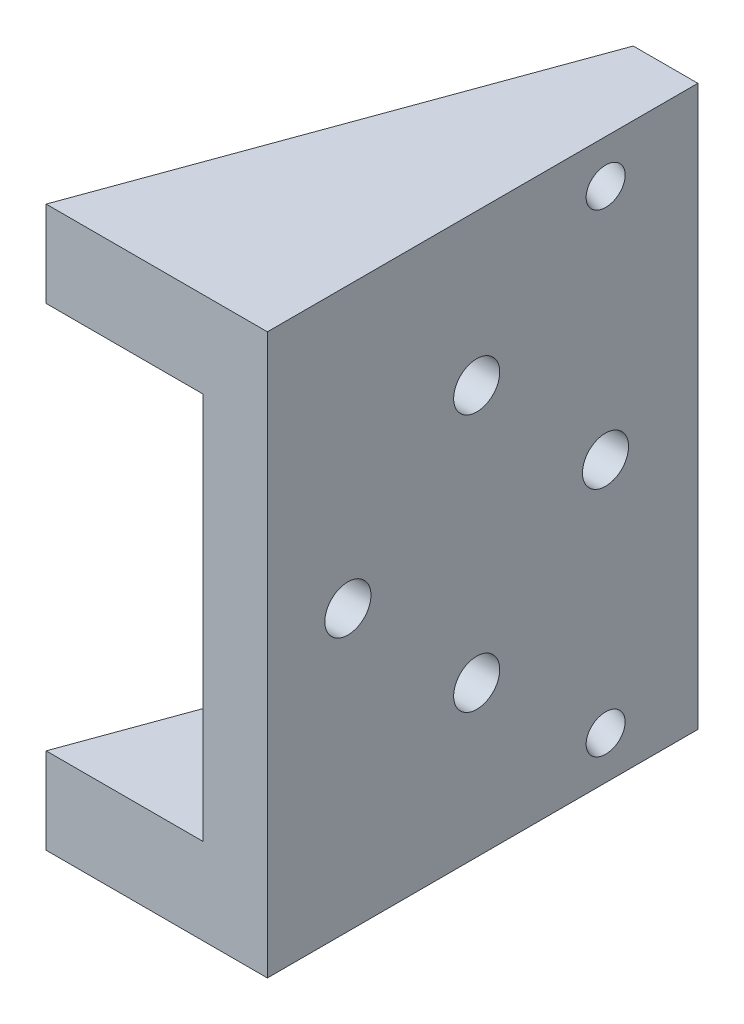
ISO-10303-21;
HEADER;
FILE_DESCRIPTION(('STEP AP214'),'2;1');
FILE_NAME('part.step','',(''),(''),'','','');
FILE_SCHEMA(('AUTOMOTIVE_DESIGN { 1 0 10303 214 1 1 1 1 }'));
ENDSEC;
DATA;
#1=APPLICATION_CONTEXT('core data for automotive mechanical design processes');
#2=APPLICATION_PROTOCOL_DEFINITION('international standard','automotive_design',2000,#1);
#3=PRODUCT_CONTEXT('',#1,'mechanical');
#4=PRODUCT('Part','Part','',(#3));
#5=PRODUCT_RELATED_PRODUCT_CATEGORY('part','',(#4));
#6=PRODUCT_DEFINITION_FORMATION('','',#4);
#7=PRODUCT_DEFINITION_CONTEXT('part definition',#1,'design');
#8=PRODUCT_DEFINITION('design','',#6,#7);
#9=PRODUCT_DEFINITION_SHAPE('','',#8);
#10=(LENGTH_UNIT() NAMED_UNIT(*) SI_UNIT(.MILLI.,.METRE.));
#11=(NAMED_UNIT(*) PLANE_ANGLE_UNIT() SI_UNIT($,.RADIAN.));
#12=(NAMED_UNIT(*) SI_UNIT($,.STERADIAN.) SOLID_ANGLE_UNIT());
#13=UNCERTAINTY_MEASURE_WITH_UNIT(LENGTH_MEASURE(1.E-05),#10,'distance_accuracy_value','');
#14=(GEOMETRIC_REPRESENTATION_CONTEXT(3) GLOBAL_UNCERTAINTY_ASSIGNED_CONTEXT((#13)) GLOBAL_UNIT_ASSIGNED_CONTEXT((#10,
#11,#12)) REPRESENTATION_CONTEXT('',''));
#15=CARTESIAN_POINT('',(0.,0.,0.));
#16=DIRECTION('',(0.,0.,1.));
#17=DIRECTION('',(1.,0.,0.));
#18=AXIS2_PLACEMENT_3D('',#15,#16,#17);
#19=CARTESIAN_POINT('',(0.,20.6375,0.));
#20=DIRECTION('',(0.939692620785908,0.,0.342020143325669));
#21=DIRECTION('',(0.342020143325669,0.,-0.939692620785908));
#22=AXIS2_PLACEMENT_3D('',#19,#20,#21);
#23=PLANE('',#22);
#24=CARTESIAN_POINT('',(-1.6288709325885,17.4625,4.47528610649289));
#25=DIRECTION('',(-0.939692620785908,0.,-0.342020143325669));
#26=DIRECTION('',(-0.342020143325669,0.,0.939692620785908));
#27=AXIS2_PLACEMENT_3D('',#24,#25,#26);
#28=CIRCLE('',#27,1.35254999999999);
#29=CARTESIAN_POINT('',(-2.09147027744363,17.4625,5.74626736073686));
#30=VERTEX_POINT('',#29);
#31=EDGE_CURVE('E407',#30,#30,#28,.T.);
#32=ORIENTED_EDGE('',*,*,#31,.F.);
#33=EDGE_LOOP('',(#32));
#34=FACE_BOUND('',#33,.T.);
#35=CARTESIAN_POINT('',(-9.2302686180015,17.4625,25.3599546034597));
#36=DIRECTION('',(-0.939692620785908,0.,-0.342020143325669));
#37=DIRECTION('',(-0.342020143325669,0.,0.939692620785908));
#38=AXIS2_PLACEMENT_3D('',#35,#36,#37);
#39=CIRCLE('',#38,1.35254999999999);
#40=CARTESIAN_POINT('',(-9.69286796285663,17.4625,26.6309358577037));
#41=VERTEX_POINT('',#40);
#42=EDGE_CURVE('E128',#41,#41,#39,.T.);
#43=ORIENTED_EDGE('',*,*,#42,.F.);
#44=EDGE_LOOP('',(#43));
#45=FACE_BOUND('',#44,.T.);
#46=DIRECTION('',(0.342020143325669,0.,-0.939692620785908));
#47=VECTOR('',#46,1.);
#48=CARTESIAN_POINT('',(-11.556054937952,14.2875,31.75));
#49=LINE('',#48,#47);
#50=CARTESIAN_POINT('',(-11.556054937952,14.2875,31.75));
#51=VERTEX_POINT('',#50);
#52=CARTESIAN_POINT('',(0.,14.2875,0.));
#53=VERTEX_POINT('',#52);
#54=EDGE_CURVE('E153',#51,#53,#49,.T.);
#55=ORIENTED_EDGE('',*,*,#54,.F.);
#56=DIRECTION('',(0.,-1.,0.));
#57=VECTOR('',#56,1.);
#58=CARTESIAN_POINT('',(-11.556054937952,20.6375,31.75));
#59=LINE('',#58,#57);
#60=CARTESIAN_POINT('',(-11.556054937952,20.6375,31.75));
#61=VERTEX_POINT('',#60);
#62=EDGE_CURVE('E203',#61,#51,#59,.T.);
#63=ORIENTED_EDGE('',*,*,#62,.F.);
#64=DIRECTION('',(-0.342020143325669,0.,0.939692620785908));
#65=VECTOR('',#64,1.);
#66=CARTESIAN_POINT('',(0.,20.6375,0.));
#67=LINE('',#66,#65);
#68=CARTESIAN_POINT('',(0.,20.6375,0.));
#69=VERTEX_POINT('',#68);
#70=EDGE_CURVE('E95',#69,#61,#67,.T.);
#71=ORIENTED_EDGE('',*,*,#70,.F.);
#72=DIRECTION('',(0.,-1.,0.));
#73=VECTOR('',#72,1.);
#74=CARTESIAN_POINT('',(0.,20.6375,0.));
#75=LINE('',#74,#73);
#76=EDGE_CURVE('E12',#69,#53,#75,.T.);
#77=ORIENTED_EDGE('',*,*,#76,.T.);
#78=EDGE_LOOP('',(#55,#63,#71,#77));
#79=FACE_BOUND('',#78,.T.);
#80=ADVANCED_FACE('F41',(#34,#45,#79),#23,.F.);
#81=CARTESIAN_POINT('',(4.7625,20.6375,31.75));
#82=DIRECTION('',(0.,0.,-1.));
#83=DIRECTION('',(-1.,0.,0.));
#84=AXIS2_PLACEMENT_3D('',#81,#82,#83);
#85=PLANE('',#84);
#86=DIRECTION('',(-1.,0.,0.));
#87=VECTOR('',#86,1.);
#88=CARTESIAN_POINT('',(-11.556054937952,14.2875,31.75));
#89=LINE('',#88,#87);
#90=CARTESIAN_POINT('',(0.,14.2875,31.75));
#91=VERTEX_POINT('',#90);
#92=EDGE_CURVE('E152',#91,#51,#89,.T.);
#93=ORIENTED_EDGE('',*,*,#92,.F.);
#94=DIRECTION('',(0.,-1.,0.));
#95=VECTOR('',#94,1.);
#96=CARTESIAN_POINT('',(0.,54.4251442761102,31.75));
#97=LINE('',#96,#95);
#98=CARTESIAN_POINT('',(0.,-14.2875,31.75));
#99=VERTEX_POINT('',#98);
#100=EDGE_CURVE('E157',#91,#99,#97,.T.);
#101=ORIENTED_EDGE('',*,*,#100,.T.);
#102=DIRECTION('',(1.,0.,0.));
#103=VECTOR('',#102,1.);
#104=CARTESIAN_POINT('',(-11.556054937952,-14.2875,31.75));
#105=LINE('',#104,#103);
#106=CARTESIAN_POINT('',(-11.556054937952,-14.2875,31.75));
#107=VERTEX_POINT('',#106);
#108=EDGE_CURVE('E145',#107,#99,#105,.T.);
#109=ORIENTED_EDGE('',*,*,#108,.F.);
#110=CARTESIAN_POINT('',(-11.556054937952,-20.6375,31.75));
#111=VERTEX_POINT('',#110);
#112=EDGE_CURVE('E202',#107,#111,#59,.T.);
#113=ORIENTED_EDGE('',*,*,#112,.T.);
#114=DIRECTION('',(1.,0.,0.));
#115=VECTOR('',#114,1.);
#116=CARTESIAN_POINT('',(4.7625,-20.6375,31.75));
#117=LINE('',#116,#115);
#118=CARTESIAN_POINT('',(4.7625,-20.6375,31.75));
#119=VERTEX_POINT('',#118);
#120=EDGE_CURVE('E196',#111,#119,#117,.T.);
#121=ORIENTED_EDGE('',*,*,#120,.T.);
#122=DIRECTION('',(0.,-1.,0.));
#123=VECTOR('',#122,1.);
#124=CARTESIAN_POINT('',(4.7625,20.6375,31.75));
#125=LINE('',#124,#123);
#126=CARTESIAN_POINT('',(4.7625,20.6375,31.75));
#127=VERTEX_POINT('',#126);
#128=EDGE_CURVE('E200',#127,#119,#125,.T.);
#129=ORIENTED_EDGE('',*,*,#128,.F.);
#130=DIRECTION('',(1.,0.,0.));
#131=VECTOR('',#130,1.);
#132=CARTESIAN_POINT('',(4.7625,20.6375,31.75));
#133=LINE('',#132,#131);
#134=EDGE_CURVE('E187',#61,#127,#133,.T.);
#135=ORIENTED_EDGE('',*,*,#134,.F.);
#136=ORIENTED_EDGE('',*,*,#62,.T.);
#137=EDGE_LOOP('',(#93,#101,#109,#113,#121,#129,#135,#136));
#138=FACE_BOUND('',#137,.T.);
#139=ADVANCED_FACE('F227',(#138),#85,.F.);
#140=CARTESIAN_POINT('',(4.7625,0.,25.8125));
#141=DIRECTION('',(1.,0.,0.));
#142=DIRECTION('',(0.,0.,-1.));
#143=AXIS2_PLACEMENT_3D('',#140,#141,#142);
#144=CYLINDRICAL_SURFACE('',#143,1.69999999999999);
#145=CARTESIAN_POINT('',(4.7625,0.,25.8125));
#146=DIRECTION('',(1.,0.,0.));
#147=DIRECTION('',(0.,0.,-1.));
#148=AXIS2_PLACEMENT_3D('',#145,#146,#147);
#149=CIRCLE('',#148,1.69999999999999);
#150=CARTESIAN_POINT('',(4.7625,0.,24.1125));
#151=VERTEX_POINT('',#150);
#152=EDGE_CURVE('E180',#151,#151,#149,.T.);
#153=ORIENTED_EDGE('',*,*,#152,.T.);
#154=EDGE_LOOP('',(#153));
#155=FACE_BOUND('',#154,.T.);
#156=CARTESIAN_POINT('',(0.,0.,25.8125));
#157=DIRECTION('',(-1.,0.,0.));
#158=DIRECTION('',(0.,0.,1.));
#159=AXIS2_PLACEMENT_3D('',#156,#157,#158);
#160=CIRCLE('',#159,1.69999999999999);
#161=CARTESIAN_POINT('',(0.,0.,27.5125));
#162=VERTEX_POINT('',#161);
#163=EDGE_CURVE('E168',#162,#162,#160,.F.);
#164=ORIENTED_EDGE('',*,*,#163,.F.);
#165=EDGE_LOOP('',(#164));
#166=FACE_BOUND('',#165,.T.);
#167=ADVANCED_FACE('F232',(#155,#166),#144,.F.);
#168=CARTESIAN_POINT('',(4.7625,-9.50000000000002,16.3125));
#169=DIRECTION('',(1.,0.,0.));
#170=DIRECTION('',(0.,0.,-1.));
#171=AXIS2_PLACEMENT_3D('',#168,#169,#170);
#172=CYLINDRICAL_SURFACE('',#171,1.69999999999999);
#173=CARTESIAN_POINT('',(4.7625,-9.50000000000002,16.3125));
#174=DIRECTION('',(1.,0.,0.));
#175=DIRECTION('',(0.,0.,-1.));
#176=AXIS2_PLACEMENT_3D('',#173,#174,#175);
#177=CIRCLE('',#176,1.69999999999999);
#178=CARTESIAN_POINT('',(4.7625,-9.50000000000002,14.6125));
#179=VERTEX_POINT('',#178);
#180=EDGE_CURVE('E177',#179,#179,#177,.T.);
#181=ORIENTED_EDGE('',*,*,#180,.T.);
#182=EDGE_LOOP('',(#181));
#183=FACE_BOUND('',#182,.T.);
#184=CARTESIAN_POINT('',(0.,-9.50000000000002,16.3125));
#185=DIRECTION('',(-1.,0.,0.));
#186=DIRECTION('',(0.,0.,1.));
#187=AXIS2_PLACEMENT_3D('',#184,#185,#186);
#188=CIRCLE('',#187,1.69999999999999);
#189=CARTESIAN_POINT('',(0.,-9.50000000000002,18.0125));
#190=VERTEX_POINT('',#189);
#191=EDGE_CURVE('E165',#190,#190,#188,.F.);
#192=ORIENTED_EDGE('',*,*,#191,.F.);
#193=EDGE_LOOP('',(#192));
#194=FACE_BOUND('',#193,.T.);
#195=ADVANCED_FACE('F222',(#183,#194),#172,.F.);
#196=CARTESIAN_POINT('',(4.7625,0.,6.81249999999996));
#197=DIRECTION('',(1.,0.,0.));
#198=DIRECTION('',(0.,0.,-1.));
#199=AXIS2_PLACEMENT_3D('',#196,#197,#198);
#200=CYLINDRICAL_SURFACE('',#199,1.69999999999999);
#201=CARTESIAN_POINT('',(4.7625,0.,6.81249999999996));
#202=DIRECTION('',(1.,0.,0.));
#203=DIRECTION('',(0.,0.,-1.));
#204=AXIS2_PLACEMENT_3D('',#201,#202,#203);
#205=CIRCLE('',#204,1.69999999999999);
#206=CARTESIAN_POINT('',(4.7625,0.,5.11249999999998));
#207=VERTEX_POINT('',#206);
#208=EDGE_CURVE('E174',#207,#207,#205,.T.);
#209=ORIENTED_EDGE('',*,*,#208,.T.);
#210=EDGE_LOOP('',(#209));
#211=FACE_BOUND('',#210,.T.);
#212=CARTESIAN_POINT('',(0.,0.,6.81249999999997));
#213=DIRECTION('',(-1.,0.,0.));
#214=DIRECTION('',(0.,0.,1.));
#215=AXIS2_PLACEMENT_3D('',#212,#213,#214);
#216=CIRCLE('',#215,1.69999999999999);
#217=CARTESIAN_POINT('',(0.,0.,8.51249999999996));
#218=VERTEX_POINT('',#217);
#219=EDGE_CURVE('E162',#218,#218,#216,.F.);
#220=ORIENTED_EDGE('',*,*,#219,.F.);
#221=EDGE_LOOP('',(#220));
#222=FACE_BOUND('',#221,.T.);
#223=ADVANCED_FACE('F213',(#211,#222),#200,.F.);
#224=CARTESIAN_POINT('',(4.7625,9.50000000000002,16.3125));
#225=DIRECTION('',(1.,0.,0.));
#226=DIRECTION('',(0.,0.,-1.));
#227=AXIS2_PLACEMENT_3D('',#224,#225,#226);
#228=CYLINDRICAL_SURFACE('',#227,1.69999999999999);
#229=CARTESIAN_POINT('',(4.7625,9.50000000000002,16.3125));
#230=DIRECTION('',(1.,0.,0.));
#231=DIRECTION('',(0.,0.,-1.));
#232=AXIS2_PLACEMENT_3D('',#229,#230,#231);
#233=CIRCLE('',#232,1.69999999999999);
#234=CARTESIAN_POINT('',(4.7625,9.50000000000002,14.6125));
#235=VERTEX_POINT('',#234);
#236=EDGE_CURVE('E171',#235,#235,#233,.T.);
#237=ORIENTED_EDGE('',*,*,#236,.T.);
#238=EDGE_LOOP('',(#237));
#239=FACE_BOUND('',#238,.T.);
#240=CARTESIAN_POINT('',(0.,9.50000000000002,16.3125));
#241=DIRECTION('',(-1.,0.,0.));
#242=DIRECTION('',(0.,0.,1.));
#243=AXIS2_PLACEMENT_3D('',#240,#241,#242);
#244=CIRCLE('',#243,1.69999999999999);
#245=CARTESIAN_POINT('',(0.,9.50000000000002,18.0125));
#246=VERTEX_POINT('',#245);
#247=EDGE_CURVE('E155',#246,#246,#244,.F.);
#248=ORIENTED_EDGE('',*,*,#247,.F.);
#249=EDGE_LOOP('',(#248));
#250=FACE_BOUND('',#249,.T.);
#251=ADVANCED_FACE('F211',(#239,#250),#228,.F.);
#252=CARTESIAN_POINT('',(0.,20.6375,0.));
#253=DIRECTION('',(0.,0.,1.));
#254=DIRECTION('',(1.,0.,0.));
#255=AXIS2_PLACEMENT_3D('',#252,#253,#254);
#256=PLANE('',#255);
#257=DIRECTION('',(-1.,0.,0.));
#258=VECTOR('',#257,1.);
#259=CARTESIAN_POINT('',(0.,-20.6375,0.));
#260=LINE('',#259,#258);
#261=CARTESIAN_POINT('',(4.7625,-20.6375,0.));
#262=VERTEX_POINT('',#261);
#263=CARTESIAN_POINT('',(0.,-20.6375,0.));
#264=VERTEX_POINT('',#263);
#265=EDGE_CURVE('E183',#262,#264,#260,.T.);
#266=ORIENTED_EDGE('',*,*,#265,.T.);
#267=CARTESIAN_POINT('',(0.,-14.2875,0.));
#268=VERTEX_POINT('',#267);
#269=EDGE_CURVE('E50',#268,#264,#75,.T.);
#270=ORIENTED_EDGE('',*,*,#269,.F.);
#271=DIRECTION('',(0.,-1.,0.));
#272=VECTOR('',#271,1.);
#273=CARTESIAN_POINT('',(0.,54.4251442761102,0.));
#274=LINE('',#273,#272);
#275=EDGE_CURVE('E147',#53,#268,#274,.T.);
#276=ORIENTED_EDGE('',*,*,#275,.F.);
#277=ORIENTED_EDGE('',*,*,#76,.F.);
#278=DIRECTION('',(-1.,0.,0.));
#279=VECTOR('',#278,1.);
#280=CARTESIAN_POINT('',(0.,20.6375,0.));
#281=LINE('',#280,#279);
#282=CARTESIAN_POINT('',(4.7625,20.6375,0.));
#283=VERTEX_POINT('',#282);
#284=EDGE_CURVE('E184',#283,#69,#281,.T.);
#285=ORIENTED_EDGE('',*,*,#284,.F.);
#286=DIRECTION('',(0.,-1.,0.));
#287=VECTOR('',#286,1.);
#288=CARTESIAN_POINT('',(4.7625,20.6375,0.));
#289=LINE('',#288,#287);
#290=EDGE_CURVE('E190',#283,#262,#289,.T.);
#291=ORIENTED_EDGE('',*,*,#290,.T.);
#292=EDGE_LOOP('',(#266,#270,#276,#277,#285,#291));
#293=FACE_BOUND('',#292,.T.);
#294=ADVANCED_FACE('F43',(#293),#256,.F.);
#295=CARTESIAN_POINT('',(-9.2302686180015,-17.4625,25.3599546034597));
#296=DIRECTION('',(-0.939692620785908,0.,-0.342020143325669));
#297=DIRECTION('',(-0.342020143325669,0.,0.939692620785908));
#298=AXIS2_PLACEMENT_3D('',#295,#296,#297);
#299=CIRCLE('',#298,1.35254999999999);
#300=CARTESIAN_POINT('',(-9.69286796285663,-17.4625,26.6309358577037));
#301=VERTEX_POINT('',#300);
#302=EDGE_CURVE('E127',#301,#301,#299,.T.);
#303=ORIENTED_EDGE('',*,*,#302,.F.);
#304=EDGE_LOOP('',(#303));
#305=FACE_BOUND('',#304,.T.);
#306=CARTESIAN_POINT('',(-1.6288709325885,-17.4625,4.47528610649289));
#307=DIRECTION('',(-0.939692620785908,0.,-0.342020143325669));
#308=DIRECTION('',(-0.342020143325669,0.,0.939692620785908));
#309=AXIS2_PLACEMENT_3D('',#306,#307,#308);
#310=CIRCLE('',#309,1.35254999999999);
#311=CARTESIAN_POINT('',(-2.09147027744363,-17.4625,5.74626736073686));
#312=VERTEX_POINT('',#311);
#313=EDGE_CURVE('E140',#312,#312,#310,.T.);
#314=ORIENTED_EDGE('',*,*,#313,.F.);
#315=EDGE_LOOP('',(#314));
#316=FACE_BOUND('',#315,.T.);
#317=ORIENTED_EDGE('',*,*,#112,.F.);
#318=DIRECTION('',(-0.342020143325669,0.,0.939692620785908));
#319=VECTOR('',#318,1.);
#320=CARTESIAN_POINT('',(-11.556054937952,-14.2875,31.75));
#321=LINE('',#320,#319);
#322=EDGE_CURVE('E58',#268,#107,#321,.T.);
#323=ORIENTED_EDGE('',*,*,#322,.F.);
#324=ORIENTED_EDGE('',*,*,#269,.T.);
#325=DIRECTION('',(-0.342020143325669,0.,0.939692620785908));
#326=VECTOR('',#325,1.);
#327=CARTESIAN_POINT('',(0.,-20.6375,0.));
#328=LINE('',#327,#326);
#329=EDGE_CURVE('E193',#264,#111,#328,.T.);
#330=ORIENTED_EDGE('',*,*,#329,.T.);
#331=EDGE_LOOP('',(#317,#323,#324,#330));
#332=FACE_BOUND('',#331,.T.);
#333=ADVANCED_FACE('F220',(#305,#316,#332),#23,.F.);
#334=CARTESIAN_POINT('',(4.7625,20.6375,0.));
#335=DIRECTION('',(-1.,0.,0.));
#336=DIRECTION('',(0.,0.,1.));
#337=AXIS2_PLACEMENT_3D('',#334,#335,#336);
#338=PLANE('',#337);
#339=CARTESIAN_POINT('',(4.7625,17.4625,6.80155488210933));
#340=DIRECTION('',(-1.,0.,0.));
#341=DIRECTION('',(0.,0.,-1.));
#342=AXIS2_PLACEMENT_3D('',#339,#340,#341);
#343=ELLIPSE('',#342,1.43935364616229,1.35254999999999);
#344=CARTESIAN_POINT('',(4.7625,17.4625,5.36220123594704));
#345=VERTEX_POINT('',#344);
#346=EDGE_CURVE('E134',#345,#345,#343,.T.);
#347=ORIENTED_EDGE('',*,*,#346,.T.);
#348=EDGE_LOOP('',(#347));
#349=FACE_BOUND('',#348,.T.);
#350=CARTESIAN_POINT('',(4.7625,-17.4625,6.80155488210933));
#351=DIRECTION('',(-1.,0.,0.));
#352=DIRECTION('',(0.,0.,-1.));
#353=AXIS2_PLACEMENT_3D('',#350,#351,#352);
#354=ELLIPSE('',#353,1.43935364616229,1.35254999999999);
#355=CARTESIAN_POINT('',(4.7625,-17.4625,5.36220123594704));
#356=VERTEX_POINT('',#355);
#357=EDGE_CURVE('E45',#356,#356,#354,.T.);
#358=ORIENTED_EDGE('',*,*,#357,.T.);
#359=EDGE_LOOP('',(#358));
#360=FACE_BOUND('',#359,.T.);
#361=ORIENTED_EDGE('',*,*,#236,.F.);
#362=EDGE_LOOP('',(#361));
#363=FACE_BOUND('',#362,.T.);
#364=ORIENTED_EDGE('',*,*,#208,.F.);
#365=EDGE_LOOP('',(#364));
#366=FACE_BOUND('',#365,.T.);
#367=ORIENTED_EDGE('',*,*,#180,.F.);
#368=EDGE_LOOP('',(#367));
#369=FACE_BOUND('',#368,.T.);
#370=ORIENTED_EDGE('',*,*,#152,.F.);
#371=EDGE_LOOP('',(#370));
#372=FACE_BOUND('',#371,.T.);
#373=DIRECTION('',(0.,0.,-1.));
#374=VECTOR('',#373,1.);
#375=CARTESIAN_POINT('',(4.7625,-20.6375,0.));
#376=LINE('',#375,#374);
#377=EDGE_CURVE('E88',#119,#262,#376,.T.);
#378=ORIENTED_EDGE('',*,*,#377,.T.);
#379=ORIENTED_EDGE('',*,*,#290,.F.);
#380=DIRECTION('',(0.,0.,-1.));
#381=VECTOR('',#380,1.);
#382=CARTESIAN_POINT('',(4.7625,20.6375,0.));
#383=LINE('',#382,#381);
#384=EDGE_CURVE('E67',#127,#283,#383,.T.);
#385=ORIENTED_EDGE('',*,*,#384,.F.);
#386=ORIENTED_EDGE('',*,*,#128,.T.);
#387=EDGE_LOOP('',(#378,#379,#385,#386));
#388=FACE_BOUND('',#387,.T.);
#389=ADVANCED_FACE('F238',(#349,#360,#363,#366,#369,#372,#388),#338,.F.);
#390=CARTESIAN_POINT('',(0.,20.6375,0.));
#391=DIRECTION('',(0.,-1.,0.));
#392=DIRECTION('',(0.,0.,-1.));
#393=AXIS2_PLACEMENT_3D('',#390,#391,#392);
#394=PLANE('',#393);
#395=ORIENTED_EDGE('',*,*,#284,.T.);
#396=ORIENTED_EDGE('',*,*,#70,.T.);
#397=ORIENTED_EDGE('',*,*,#134,.T.);
#398=ORIENTED_EDGE('',*,*,#384,.T.);
#399=EDGE_LOOP('',(#395,#396,#397,#398));
#400=FACE_BOUND('',#399,.T.);
#401=ADVANCED_FACE('F243',(#400),#394,.F.);
#402=CARTESIAN_POINT('',(0.,-20.6375,0.));
#403=DIRECTION('',(0.,-1.,0.));
#404=DIRECTION('',(0.,0.,-1.));
#405=AXIS2_PLACEMENT_3D('',#402,#403,#404);
#406=PLANE('',#405);
#407=ORIENTED_EDGE('',*,*,#265,.F.);
#408=ORIENTED_EDGE('',*,*,#377,.F.);
#409=ORIENTED_EDGE('',*,*,#120,.F.);
#410=ORIENTED_EDGE('',*,*,#329,.F.);
#411=EDGE_LOOP('',(#407,#408,#409,#410));
#412=FACE_BOUND('',#411,.T.);
#413=ADVANCED_FACE('F266',(#412),#406,.T.);
#414=CARTESIAN_POINT('',(0.,54.4251442761102,31.75));
#415=DIRECTION('',(-1.,0.,0.));
#416=DIRECTION('',(0.,0.,1.));
#417=AXIS2_PLACEMENT_3D('',#414,#415,#416);
#418=PLANE('',#417);
#419=ORIENTED_EDGE('',*,*,#275,.T.);
#420=DIRECTION('',(0.,0.,-1.));
#421=VECTOR('',#420,1.);
#422=CARTESIAN_POINT('',(0.,-14.2875,31.75));
#423=LINE('',#422,#421);
#424=EDGE_CURVE('E143',#99,#268,#423,.T.);
#425=ORIENTED_EDGE('',*,*,#424,.F.);
#426=ORIENTED_EDGE('',*,*,#100,.F.);
#427=DIRECTION('',(0.,0.,1.));
#428=VECTOR('',#427,1.);
#429=CARTESIAN_POINT('',(0.,14.2875,31.75));
#430=LINE('',#429,#428);
#431=EDGE_CURVE('E149',#53,#91,#430,.T.);
#432=ORIENTED_EDGE('',*,*,#431,.F.);
#433=EDGE_LOOP('',(#419,#425,#426,#432));
#434=FACE_BOUND('',#433,.T.);
#435=ORIENTED_EDGE('',*,*,#247,.T.);
#436=EDGE_LOOP('',(#435));
#437=FACE_BOUND('',#436,.T.);
#438=ORIENTED_EDGE('',*,*,#219,.T.);
#439=EDGE_LOOP('',(#438));
#440=FACE_BOUND('',#439,.T.);
#441=ORIENTED_EDGE('',*,*,#191,.T.);
#442=EDGE_LOOP('',(#441));
#443=FACE_BOUND('',#442,.T.);
#444=ORIENTED_EDGE('',*,*,#163,.T.);
#445=EDGE_LOOP('',(#444));
#446=FACE_BOUND('',#445,.T.);
#447=ADVANCED_FACE('F208',(#434,#437,#440,#443,#446),#418,.T.);
#448=CARTESIAN_POINT('',(0.,14.2875,0.));
#449=DIRECTION('',(0.,-1.,0.));
#450=DIRECTION('',(0.,0.,-1.));
#451=AXIS2_PLACEMENT_3D('',#448,#449,#450);
#452=PLANE('',#451);
#453=ORIENTED_EDGE('',*,*,#431,.T.);
#454=ORIENTED_EDGE('',*,*,#92,.T.);
#455=ORIENTED_EDGE('',*,*,#54,.T.);
#456=EDGE_LOOP('',(#453,#454,#455));
#457=FACE_BOUND('',#456,.T.);
#458=ADVANCED_FACE('F273',(#457),#452,.T.);
#459=CARTESIAN_POINT('',(0.,-14.2875,0.));
#460=DIRECTION('',(0.,-1.,0.));
#461=DIRECTION('',(0.,0.,-1.));
#462=AXIS2_PLACEMENT_3D('',#459,#460,#461);
#463=PLANE('',#462);
#464=ORIENTED_EDGE('',*,*,#108,.T.);
#465=ORIENTED_EDGE('',*,*,#424,.T.);
#466=ORIENTED_EDGE('',*,*,#322,.T.);
#467=EDGE_LOOP('',(#464,#465,#466));
#468=FACE_BOUND('',#467,.T.);
#469=ADVANCED_FACE('F256',(#468),#463,.F.);
#470=CARTESIAN_POINT('',(-1.6288709325885,-17.4625,4.47528610649289));
#471=DIRECTION('',(-0.939692620785908,0.,-0.342020143325669));
#472=DIRECTION('',(-0.342020143325669,0.,0.939692620785908));
#473=AXIS2_PLACEMENT_3D('',#470,#471,#472);
#474=CYLINDRICAL_SURFACE('',#473,1.35254999999999);
#475=ORIENTED_EDGE('',*,*,#313,.T.);
#476=EDGE_LOOP('',(#475));
#477=FACE_BOUND('',#476,.T.);
#478=ORIENTED_EDGE('',*,*,#357,.F.);
#479=EDGE_LOOP('',(#478));
#480=FACE_BOUND('',#479,.T.);
#481=ADVANCED_FACE('F334',(#477,#480),#474,.F.);
#482=CARTESIAN_POINT('',(-1.35376507057402,-17.4625,28.2267674448155));
#483=DIRECTION('',(-0.939692620785908,0.,-0.342020143325669));
#484=DIRECTION('',(-0.342020143325669,0.,0.939692620785908));
#485=AXIS2_PLACEMENT_3D('',#482,#483,#484);
#486=CONICAL_SURFACE('',#485,1.35255,1.02974425867665);
#487=CARTESIAN_POINT('',(-0.590082487376553,-17.4625,28.5047251735269));
#488=VERTEX_POINT('',#487);
#489=VERTEX_LOOP('',#488);
#490=FACE_BOUND('',#489,.T.);
#491=CARTESIAN_POINT('',(-1.35376507057402,-17.4625,28.2267674448155));
#492=DIRECTION('',(-0.939692620785908,0.,-0.342020143325669));
#493=DIRECTION('',(-0.342020143325669,0.,0.939692620785908));
#494=AXIS2_PLACEMENT_3D('',#491,#492,#493);
#495=CIRCLE('',#494,1.35255);
#496=CARTESIAN_POINT('',(-1.81636441542915,-17.4625,29.4977486990594));
#497=VERTEX_POINT('',#496);
#498=EDGE_CURVE('E131',#497,#497,#495,.T.);
#499=ORIENTED_EDGE('',*,*,#498,.T.);
#500=EDGE_LOOP('',(#499));
#501=FACE_BOUND('',#500,.T.);
#502=ADVANCED_FACE('F358',(#490,#501),#486,.F.);
#503=CARTESIAN_POINT('',(-9.2302686180015,-17.4625,25.3599546034597));
#504=DIRECTION('',(-0.939692620785908,0.,-0.342020143325669));
#505=DIRECTION('',(-0.342020143325669,0.,0.939692620785908));
#506=AXIS2_PLACEMENT_3D('',#503,#504,#505);
#507=CYLINDRICAL_SURFACE('',#506,1.35254999999999);
#508=ORIENTED_EDGE('',*,*,#498,.F.);
#509=EDGE_LOOP('',(#508));
#510=FACE_BOUND('',#509,.T.);
#511=ORIENTED_EDGE('',*,*,#302,.T.);
#512=EDGE_LOOP('',(#511));
#513=FACE_BOUND('',#512,.T.);
#514=ADVANCED_FACE('F121',(#510,#513),#507,.F.);
#515=CARTESIAN_POINT('',(-1.35376507057402,17.4625,28.2267674448155));
#516=DIRECTION('',(-0.939692620785908,0.,-0.342020143325669));
#517=DIRECTION('',(-0.342020143325669,0.,0.939692620785908));
#518=AXIS2_PLACEMENT_3D('',#515,#516,#517);
#519=CONICAL_SURFACE('',#518,1.35255,1.02974425867665);
#520=CARTESIAN_POINT('',(-0.590082487376553,17.4625,28.5047251735269));
#521=VERTEX_POINT('',#520);
#522=VERTEX_LOOP('',#521);
#523=FACE_BOUND('',#522,.T.);
#524=CARTESIAN_POINT('',(-1.35376507057402,17.4625,28.2267674448155));
#525=DIRECTION('',(-0.939692620785908,0.,-0.342020143325669));
#526=DIRECTION('',(-0.342020143325669,0.,0.939692620785908));
#527=AXIS2_PLACEMENT_3D('',#524,#525,#526);
#528=CIRCLE('',#527,1.35255);
#529=CARTESIAN_POINT('',(-1.81636441542915,17.4625,29.4977486990594));
#530=VERTEX_POINT('',#529);
#531=EDGE_CURVE('E125',#530,#530,#528,.T.);
#532=ORIENTED_EDGE('',*,*,#531,.T.);
#533=EDGE_LOOP('',(#532));
#534=FACE_BOUND('',#533,.T.);
#535=ADVANCED_FACE('F117',(#523,#534),#519,.F.);
#536=CARTESIAN_POINT('',(-9.2302686180015,17.4625,25.3599546034597));
#537=DIRECTION('',(-0.939692620785908,0.,-0.342020143325669));
#538=DIRECTION('',(-0.342020143325669,0.,0.939692620785908));
#539=AXIS2_PLACEMENT_3D('',#536,#537,#538);
#540=CYLINDRICAL_SURFACE('',#539,1.35254999999999);
#541=ORIENTED_EDGE('',*,*,#531,.F.);
#542=EDGE_LOOP('',(#541));
#543=FACE_BOUND('',#542,.T.);
#544=ORIENTED_EDGE('',*,*,#42,.T.);
#545=EDGE_LOOP('',(#544));
#546=FACE_BOUND('',#545,.T.);
#547=ADVANCED_FACE('F120',(#543,#546),#540,.F.);
#548=CARTESIAN_POINT('',(-1.6288709325885,17.4625,4.47528610649289));
#549=DIRECTION('',(-0.939692620785908,0.,-0.342020143325669));
#550=DIRECTION('',(-0.342020143325669,0.,0.939692620785908));
#551=AXIS2_PLACEMENT_3D('',#548,#549,#550);
#552=CYLINDRICAL_SURFACE('',#551,1.35254999999999);
#553=ORIENTED_EDGE('',*,*,#31,.T.);
#554=EDGE_LOOP('',(#553));
#555=FACE_BOUND('',#554,.T.);
#556=ORIENTED_EDGE('',*,*,#346,.F.);
#557=EDGE_LOOP('',(#556));
#558=FACE_BOUND('',#557,.T.);
#559=ADVANCED_FACE('F392',(#555,#558),#552,.F.);
#560=CLOSED_SHELL('',(#80,#139,#167,#195,#223,#251,#294,#333,#389,#401,#413,#447,#458,#469,#481,
#502,#514,#535,#547,#559));
#561=MANIFOLD_SOLID_BREP('B2',#560);
#562=ADVANCED_BREP_SHAPE_REPRESENTATION('',(#18,#561),#14);
#563=SHAPE_DEFINITION_REPRESENTATION(#9,#562);
ENDSEC;
END-ISO-10303-21;
